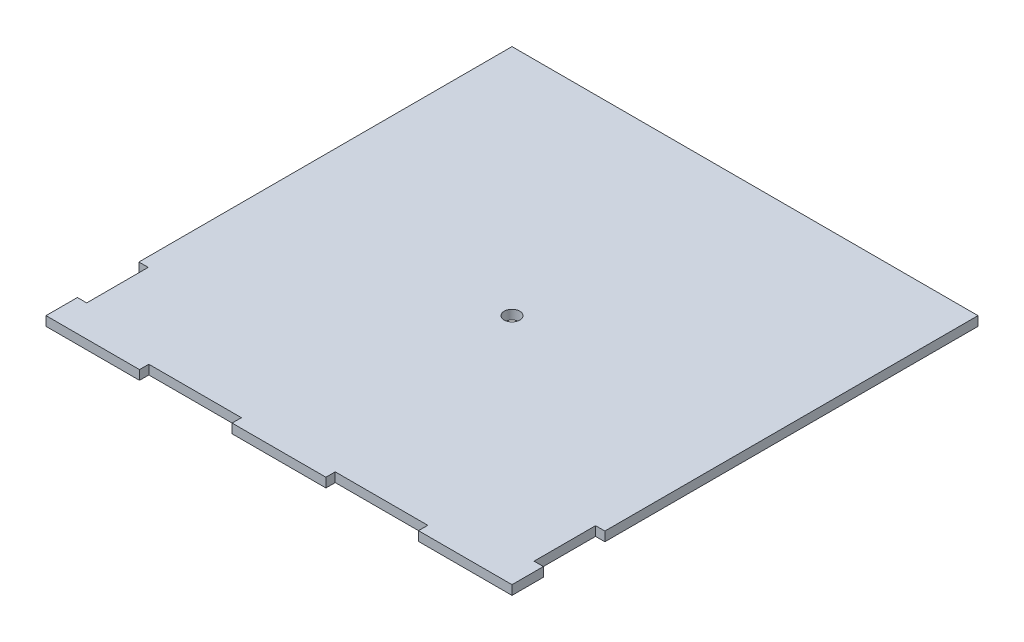
ISO-10303-21;
HEADER;
FILE_DESCRIPTION(('STEP AP214'),'2;1');
FILE_NAME('part.step','',(''),(''),'','','');
FILE_SCHEMA(('AUTOMOTIVE_DESIGN { 1 0 10303 214 1 1 1 1 }'));
ENDSEC;
DATA;
#1=APPLICATION_CONTEXT('core data for automotive mechanical design processes');
#2=APPLICATION_PROTOCOL_DEFINITION('international standard','automotive_design',2000,#1);
#3=PRODUCT_CONTEXT('',#1,'mechanical');
#4=PRODUCT('Part','Part','',(#3));
#5=PRODUCT_RELATED_PRODUCT_CATEGORY('part','',(#4));
#6=PRODUCT_DEFINITION_FORMATION('','',#4);
#7=PRODUCT_DEFINITION_CONTEXT('part definition',#1,'design');
#8=PRODUCT_DEFINITION('design','',#6,#7);
#9=PRODUCT_DEFINITION_SHAPE('','',#8);
#10=(LENGTH_UNIT() NAMED_UNIT(*) SI_UNIT(.MILLI.,.METRE.));
#11=(NAMED_UNIT(*) PLANE_ANGLE_UNIT() SI_UNIT($,.RADIAN.));
#12=(NAMED_UNIT(*) SI_UNIT($,.STERADIAN.) SOLID_ANGLE_UNIT());
#13=UNCERTAINTY_MEASURE_WITH_UNIT(LENGTH_MEASURE(1.E-05),#10,'distance_accuracy_value','');
#14=(GEOMETRIC_REPRESENTATION_CONTEXT(3) GLOBAL_UNCERTAINTY_ASSIGNED_CONTEXT((#13)) GLOBAL_UNIT_ASSIGNED_CONTEXT((#10,
#11,#12)) REPRESENTATION_CONTEXT('',''));
#15=CARTESIAN_POINT('',(0.,0.,0.));
#16=DIRECTION('',(0.,0.,1.));
#17=DIRECTION('',(1.,0.,0.));
#18=AXIS2_PLACEMENT_3D('',#15,#16,#17);
#19=CARTESIAN_POINT('',(0.,3.,0.));
#20=DIRECTION('',(-1.,0.,0.));
#21=DIRECTION('',(0.,0.,1.));
#22=AXIS2_PLACEMENT_3D('',#19,#20,#21);
#23=PLANE('',#22);
#24=DIRECTION('',(0.,0.,-1.));
#25=VECTOR('',#24,1.);
#26=CARTESIAN_POINT('',(0.,0.,0.));
#27=LINE('',#26,#25);
#28=CARTESIAN_POINT('',(0.,0.,-29.8999999999996));
#29=VERTEX_POINT('',#28);
#30=CARTESIAN_POINT('',(0.,0.,-150.));
#31=VERTEX_POINT('',#30);
#32=EDGE_CURVE('E208',#29,#31,#27,.T.);
#33=ORIENTED_EDGE('',*,*,#32,.F.);
#34=DIRECTION('',(0.,-1.,0.));
#35=VECTOR('',#34,1.);
#36=CARTESIAN_POINT('',(0.,3.,-29.8999999999996));
#37=LINE('',#36,#35);
#38=CARTESIAN_POINT('',(0.,3.,-29.8999999999996));
#39=VERTEX_POINT('',#38);
#40=EDGE_CURVE('E11',#39,#29,#37,.T.);
#41=ORIENTED_EDGE('',*,*,#40,.F.);
#42=DIRECTION('',(0.,0.,-1.));
#43=VECTOR('',#42,1.);
#44=CARTESIAN_POINT('',(0.,3.,0.));
#45=LINE('',#44,#43);
#46=CARTESIAN_POINT('',(0.,3.,-150.));
#47=VERTEX_POINT('',#46);
#48=EDGE_CURVE('E348',#39,#47,#45,.T.);
#49=ORIENTED_EDGE('',*,*,#48,.T.);
#50=DIRECTION('',(0.,-1.,0.));
#51=VECTOR('',#50,1.);
#52=CARTESIAN_POINT('',(0.,3.,-150.));
#53=LINE('',#52,#51);
#54=EDGE_CURVE('E53',#47,#31,#53,.T.);
#55=ORIENTED_EDGE('',*,*,#54,.T.);
#56=EDGE_LOOP('',(#33,#41,#49,#55));
#57=FACE_BOUND('',#56,.T.);
#58=ADVANCED_FACE('F36',(#57),#23,.T.);
#59=CARTESIAN_POINT('',(0.,3.,-29.8999999999996));
#60=DIRECTION('',(0.,0.,-1.));
#61=DIRECTION('',(-1.,0.,0.));
#62=AXIS2_PLACEMENT_3D('',#59,#60,#61);
#63=PLANE('',#62);
#64=DIRECTION('',(1.,0.,0.));
#65=VECTOR('',#64,1.);
#66=CARTESIAN_POINT('',(0.,0.,-29.8999999999996));
#67=LINE('',#66,#65);
#68=CARTESIAN_POINT('',(3.00000000000086,0.,-29.8999999999996));
#69=VERTEX_POINT('',#68);
#70=EDGE_CURVE('E210',#29,#69,#67,.T.);
#71=ORIENTED_EDGE('',*,*,#70,.T.);
#72=DIRECTION('',(0.,-1.,0.));
#73=VECTOR('',#72,1.);
#74=CARTESIAN_POINT('',(3.00000000000086,3.,-29.8999999999996));
#75=LINE('',#74,#73);
#76=CARTESIAN_POINT('',(3.00000000000086,3.,-29.8999999999996));
#77=VERTEX_POINT('',#76);
#78=EDGE_CURVE('E45',#77,#69,#75,.T.);
#79=ORIENTED_EDGE('',*,*,#78,.F.);
#80=DIRECTION('',(1.,0.,0.));
#81=VECTOR('',#80,1.);
#82=CARTESIAN_POINT('',(0.,3.,-29.8999999999996));
#83=LINE('',#82,#81);
#84=EDGE_CURVE('E352',#39,#77,#83,.T.);
#85=ORIENTED_EDGE('',*,*,#84,.F.);
#86=ORIENTED_EDGE('',*,*,#40,.T.);
#87=EDGE_LOOP('',(#71,#79,#85,#86));
#88=FACE_BOUND('',#87,.T.);
#89=ADVANCED_FACE('F303',(#88),#63,.F.);
#90=CARTESIAN_POINT('',(3.00000000000107,3.,0.));
#91=DIRECTION('',(1.,0.,0.));
#92=DIRECTION('',(0.,0.,-1.));
#93=AXIS2_PLACEMENT_3D('',#90,#91,#92);
#94=PLANE('',#93);
#95=DIRECTION('',(0.,0.,1.));
#96=VECTOR('',#95,1.);
#97=CARTESIAN_POINT('',(3.00000000000107,0.,0.));
#98=LINE('',#97,#96);
#99=CARTESIAN_POINT('',(3.000000000001,0.,-10.0999999999996));
#100=VERTEX_POINT('',#99);
#101=EDGE_CURVE('E214',#69,#100,#98,.T.);
#102=ORIENTED_EDGE('',*,*,#101,.T.);
#103=DIRECTION('',(0.,-1.,0.));
#104=VECTOR('',#103,1.);
#105=CARTESIAN_POINT('',(3.000000000001,3.,-10.0999999999996));
#106=LINE('',#105,#104);
#107=CARTESIAN_POINT('',(3.000000000001,3.,-10.0999999999996));
#108=VERTEX_POINT('',#107);
#109=EDGE_CURVE('E293',#108,#100,#106,.T.);
#110=ORIENTED_EDGE('',*,*,#109,.F.);
#111=DIRECTION('',(0.,0.,1.));
#112=VECTOR('',#111,1.);
#113=CARTESIAN_POINT('',(3.00000000000107,3.,0.));
#114=LINE('',#113,#112);
#115=EDGE_CURVE('E299',#77,#108,#114,.T.);
#116=ORIENTED_EDGE('',*,*,#115,.F.);
#117=ORIENTED_EDGE('',*,*,#78,.T.);
#118=EDGE_LOOP('',(#102,#110,#116,#117));
#119=FACE_BOUND('',#118,.T.);
#120=ADVANCED_FACE('F297',(#119),#94,.F.);
#121=CARTESIAN_POINT('',(0.,3.,-10.0999999999996));
#122=DIRECTION('',(0.,0.,-1.));
#123=DIRECTION('',(-1.,0.,0.));
#124=AXIS2_PLACEMENT_3D('',#121,#122,#123);
#125=PLANE('',#124);
#126=DIRECTION('',(1.,0.,0.));
#127=VECTOR('',#126,1.);
#128=CARTESIAN_POINT('',(0.,0.,-10.0999999999996));
#129=LINE('',#128,#127);
#130=CARTESIAN_POINT('',(0.,0.,-10.0999999999996));
#131=VERTEX_POINT('',#130);
#132=EDGE_CURVE('E217',#131,#100,#129,.T.);
#133=ORIENTED_EDGE('',*,*,#132,.F.);
#134=DIRECTION('',(0.,-1.,0.));
#135=VECTOR('',#134,1.);
#136=CARTESIAN_POINT('',(0.,3.,-10.0999999999996));
#137=LINE('',#136,#135);
#138=CARTESIAN_POINT('',(0.,3.,-10.0999999999996));
#139=VERTEX_POINT('',#138);
#140=EDGE_CURVE('E291',#139,#131,#137,.T.);
#141=ORIENTED_EDGE('',*,*,#140,.F.);
#142=DIRECTION('',(1.,0.,0.));
#143=VECTOR('',#142,1.);
#144=CARTESIAN_POINT('',(0.,3.,-10.0999999999996));
#145=LINE('',#144,#143);
#146=EDGE_CURVE('E346',#139,#108,#145,.T.);
#147=ORIENTED_EDGE('',*,*,#146,.T.);
#148=ORIENTED_EDGE('',*,*,#109,.T.);
#149=EDGE_LOOP('',(#133,#141,#147,#148));
#150=FACE_BOUND('',#149,.T.);
#151=ADVANCED_FACE('F316',(#150),#125,.T.);
#152=CARTESIAN_POINT('',(0.,0.,0.));
#153=VERTEX_POINT('',#152);
#154=EDGE_CURVE('E211',#153,#131,#27,.T.);
#155=ORIENTED_EDGE('',*,*,#154,.F.);
#156=DIRECTION('',(0.,-1.,0.));
#157=VECTOR('',#156,1.);
#158=CARTESIAN_POINT('',(0.,3.,0.));
#159=LINE('',#158,#157);
#160=CARTESIAN_POINT('',(0.,3.,0.));
#161=VERTEX_POINT('',#160);
#162=EDGE_CURVE('E289',#161,#153,#159,.T.);
#163=ORIENTED_EDGE('',*,*,#162,.F.);
#164=EDGE_CURVE('E340',#161,#139,#45,.T.);
#165=ORIENTED_EDGE('',*,*,#164,.T.);
#166=ORIENTED_EDGE('',*,*,#140,.T.);
#167=EDGE_LOOP('',(#155,#163,#165,#166));
#168=FACE_BOUND('',#167,.T.);
#169=ADVANCED_FACE('F308',(#168),#23,.T.);
#170=CARTESIAN_POINT('',(0.,3.,0.));
#171=DIRECTION('',(0.,0.,-1.));
#172=DIRECTION('',(-1.,0.,0.));
#173=AXIS2_PLACEMENT_3D('',#170,#171,#172);
#174=PLANE('',#173);
#175=DIRECTION('',(1.,0.,0.));
#176=VECTOR('',#175,1.);
#177=CARTESIAN_POINT('',(0.,0.,0.));
#178=LINE('',#177,#176);
#179=CARTESIAN_POINT('',(30.1,0.,0.));
#180=VERTEX_POINT('',#179);
#181=EDGE_CURVE('E220',#153,#180,#178,.T.);
#182=ORIENTED_EDGE('',*,*,#181,.T.);
#183=DIRECTION('',(0.,-1.,0.));
#184=VECTOR('',#183,1.);
#185=CARTESIAN_POINT('',(30.1,3.,0.));
#186=LINE('',#185,#184);
#187=CARTESIAN_POINT('',(30.1,3.,0.));
#188=VERTEX_POINT('',#187);
#189=EDGE_CURVE('E286',#188,#180,#186,.T.);
#190=ORIENTED_EDGE('',*,*,#189,.F.);
#191=DIRECTION('',(1.,0.,0.));
#192=VECTOR('',#191,1.);
#193=CARTESIAN_POINT('',(0.,3.,0.));
#194=LINE('',#193,#192);
#195=EDGE_CURVE('E336',#161,#188,#194,.T.);
#196=ORIENTED_EDGE('',*,*,#195,.F.);
#197=ORIENTED_EDGE('',*,*,#162,.T.);
#198=EDGE_LOOP('',(#182,#190,#196,#197));
#199=FACE_BOUND('',#198,.T.);
#200=ADVANCED_FACE('F315',(#199),#174,.F.);
#201=CARTESIAN_POINT('',(30.1,3.,0.));
#202=DIRECTION('',(-1.,0.,0.));
#203=DIRECTION('',(0.,0.,1.));
#204=AXIS2_PLACEMENT_3D('',#201,#202,#203);
#205=PLANE('',#204);
#206=DIRECTION('',(0.,0.,-1.));
#207=VECTOR('',#206,1.);
#208=CARTESIAN_POINT('',(30.1,0.,0.));
#209=LINE('',#208,#207);
#210=CARTESIAN_POINT('',(30.1,0.,-3.));
#211=VERTEX_POINT('',#210);
#212=EDGE_CURVE('E223',#180,#211,#209,.T.);
#213=ORIENTED_EDGE('',*,*,#212,.T.);
#214=DIRECTION('',(0.,-1.,0.));
#215=VECTOR('',#214,1.);
#216=CARTESIAN_POINT('',(30.1,3.,-3.));
#217=LINE('',#216,#215);
#218=CARTESIAN_POINT('',(30.1,3.,-3.));
#219=VERTEX_POINT('',#218);
#220=EDGE_CURVE('E283',#219,#211,#217,.T.);
#221=ORIENTED_EDGE('',*,*,#220,.F.);
#222=DIRECTION('',(0.,0.,-1.));
#223=VECTOR('',#222,1.);
#224=CARTESIAN_POINT('',(30.1,3.,0.));
#225=LINE('',#224,#223);
#226=EDGE_CURVE('E339',#188,#219,#225,.T.);
#227=ORIENTED_EDGE('',*,*,#226,.F.);
#228=ORIENTED_EDGE('',*,*,#189,.T.);
#229=EDGE_LOOP('',(#213,#221,#227,#228));
#230=FACE_BOUND('',#229,.T.);
#231=ADVANCED_FACE('F322',(#230),#205,.F.);
#232=CARTESIAN_POINT('',(0.,3.,-3.));
#233=DIRECTION('',(0.,0.,-1.));
#234=DIRECTION('',(-1.,0.,0.));
#235=AXIS2_PLACEMENT_3D('',#232,#233,#234);
#236=PLANE('',#235);
#237=DIRECTION('',(1.,0.,0.));
#238=VECTOR('',#237,1.);
#239=CARTESIAN_POINT('',(0.,0.,-3.));
#240=LINE('',#239,#238);
#241=CARTESIAN_POINT('',(59.9,0.,-3.));
#242=VERTEX_POINT('',#241);
#243=EDGE_CURVE('E228',#211,#242,#240,.T.);
#244=ORIENTED_EDGE('',*,*,#243,.T.);
#245=DIRECTION('',(0.,-1.,0.));
#246=VECTOR('',#245,1.);
#247=CARTESIAN_POINT('',(59.9,3.,-3.));
#248=LINE('',#247,#246);
#249=CARTESIAN_POINT('',(59.9,3.,-3.));
#250=VERTEX_POINT('',#249);
#251=EDGE_CURVE('E281',#250,#242,#248,.T.);
#252=ORIENTED_EDGE('',*,*,#251,.F.);
#253=DIRECTION('',(1.,0.,0.));
#254=VECTOR('',#253,1.);
#255=CARTESIAN_POINT('',(0.,3.,-3.));
#256=LINE('',#255,#254);
#257=EDGE_CURVE('E408',#219,#250,#256,.T.);
#258=ORIENTED_EDGE('',*,*,#257,.F.);
#259=ORIENTED_EDGE('',*,*,#220,.T.);
#260=EDGE_LOOP('',(#244,#252,#258,#259));
#261=FACE_BOUND('',#260,.T.);
#262=ADVANCED_FACE('F399',(#261),#236,.F.);
#263=CARTESIAN_POINT('',(59.9,3.,0.));
#264=DIRECTION('',(-1.,0.,0.));
#265=DIRECTION('',(0.,0.,1.));
#266=AXIS2_PLACEMENT_3D('',#263,#264,#265);
#267=PLANE('',#266);
#268=DIRECTION('',(0.,0.,-1.));
#269=VECTOR('',#268,1.);
#270=CARTESIAN_POINT('',(59.9,0.,0.));
#271=LINE('',#270,#269);
#272=CARTESIAN_POINT('',(59.9,0.,0.));
#273=VERTEX_POINT('',#272);
#274=EDGE_CURVE('E231',#273,#242,#271,.T.);
#275=ORIENTED_EDGE('',*,*,#274,.F.);
#276=DIRECTION('',(0.,-1.,0.));
#277=VECTOR('',#276,1.);
#278=CARTESIAN_POINT('',(59.9,3.,0.));
#279=LINE('',#278,#277);
#280=CARTESIAN_POINT('',(59.9,3.,0.));
#281=VERTEX_POINT('',#280);
#282=EDGE_CURVE('E279',#281,#273,#279,.T.);
#283=ORIENTED_EDGE('',*,*,#282,.F.);
#284=DIRECTION('',(0.,0.,-1.));
#285=VECTOR('',#284,1.);
#286=CARTESIAN_POINT('',(59.9,3.,0.));
#287=LINE('',#286,#285);
#288=EDGE_CURVE('E410',#281,#250,#287,.T.);
#289=ORIENTED_EDGE('',*,*,#288,.T.);
#290=ORIENTED_EDGE('',*,*,#251,.T.);
#291=EDGE_LOOP('',(#275,#283,#289,#290));
#292=FACE_BOUND('',#291,.T.);
#293=ADVANCED_FACE('F396',(#292),#267,.T.);
#294=CARTESIAN_POINT('',(90.1,0.,0.));
#295=VERTEX_POINT('',#294);
#296=EDGE_CURVE('E225',#273,#295,#178,.T.);
#297=ORIENTED_EDGE('',*,*,#296,.T.);
#298=DIRECTION('',(0.,-1.,0.));
#299=VECTOR('',#298,1.);
#300=CARTESIAN_POINT('',(90.1,3.,0.));
#301=LINE('',#300,#299);
#302=CARTESIAN_POINT('',(90.1,3.,0.));
#303=VERTEX_POINT('',#302);
#304=EDGE_CURVE('E276',#303,#295,#301,.T.);
#305=ORIENTED_EDGE('',*,*,#304,.F.);
#306=EDGE_CURVE('E343',#281,#303,#194,.T.);
#307=ORIENTED_EDGE('',*,*,#306,.F.);
#308=ORIENTED_EDGE('',*,*,#282,.T.);
#309=EDGE_LOOP('',(#297,#305,#307,#308));
#310=FACE_BOUND('',#309,.T.);
#311=ADVANCED_FACE('F325',(#310),#174,.F.);
#312=CARTESIAN_POINT('',(90.1,3.,0.));
#313=DIRECTION('',(-1.,0.,0.));
#314=DIRECTION('',(0.,0.,1.));
#315=AXIS2_PLACEMENT_3D('',#312,#313,#314);
#316=PLANE('',#315);
#317=DIRECTION('',(0.,0.,-1.));
#318=VECTOR('',#317,1.);
#319=CARTESIAN_POINT('',(90.1,0.,0.));
#320=LINE('',#319,#318);
#321=CARTESIAN_POINT('',(90.1,0.,-3.));
#322=VERTEX_POINT('',#321);
#323=EDGE_CURVE('E234',#295,#322,#320,.T.);
#324=ORIENTED_EDGE('',*,*,#323,.T.);
#325=DIRECTION('',(0.,-1.,0.));
#326=VECTOR('',#325,1.);
#327=CARTESIAN_POINT('',(90.1,3.,-3.));
#328=LINE('',#327,#326);
#329=CARTESIAN_POINT('',(90.1,3.,-3.));
#330=VERTEX_POINT('',#329);
#331=EDGE_CURVE('E273',#330,#322,#328,.T.);
#332=ORIENTED_EDGE('',*,*,#331,.F.);
#333=DIRECTION('',(0.,0.,-1.));
#334=VECTOR('',#333,1.);
#335=CARTESIAN_POINT('',(90.1,3.,0.));
#336=LINE('',#335,#334);
#337=EDGE_CURVE('E415',#303,#330,#336,.T.);
#338=ORIENTED_EDGE('',*,*,#337,.F.);
#339=ORIENTED_EDGE('',*,*,#304,.T.);
#340=EDGE_LOOP('',(#324,#332,#338,#339));
#341=FACE_BOUND('',#340,.T.);
#342=ADVANCED_FACE('F391',(#341),#316,.F.);
#343=CARTESIAN_POINT('',(0.,3.,-3.));
#344=DIRECTION('',(0.,0.,-1.));
#345=DIRECTION('',(-1.,0.,0.));
#346=AXIS2_PLACEMENT_3D('',#343,#344,#345);
#347=PLANE('',#346);
#348=DIRECTION('',(1.,0.,0.));
#349=VECTOR('',#348,1.);
#350=CARTESIAN_POINT('',(0.,0.,-3.));
#351=LINE('',#350,#349);
#352=CARTESIAN_POINT('',(119.9,0.,-3.));
#353=VERTEX_POINT('',#352);
#354=EDGE_CURVE('E237',#322,#353,#351,.T.);
#355=ORIENTED_EDGE('',*,*,#354,.T.);
#356=DIRECTION('',(0.,-1.,0.));
#357=VECTOR('',#356,1.);
#358=CARTESIAN_POINT('',(119.9,3.,-3.));
#359=LINE('',#358,#357);
#360=CARTESIAN_POINT('',(119.9,3.,-3.));
#361=VERTEX_POINT('',#360);
#362=EDGE_CURVE('E271',#361,#353,#359,.T.);
#363=ORIENTED_EDGE('',*,*,#362,.F.);
#364=DIRECTION('',(1.,0.,0.));
#365=VECTOR('',#364,1.);
#366=CARTESIAN_POINT('',(0.,3.,-3.));
#367=LINE('',#366,#365);
#368=EDGE_CURVE('E418',#330,#361,#367,.T.);
#369=ORIENTED_EDGE('',*,*,#368,.F.);
#370=ORIENTED_EDGE('',*,*,#331,.T.);
#371=EDGE_LOOP('',(#355,#363,#369,#370));
#372=FACE_BOUND('',#371,.T.);
#373=ADVANCED_FACE('F387',(#372),#347,.F.);
#374=CARTESIAN_POINT('',(119.9,3.,0.));
#375=DIRECTION('',(-1.,0.,0.));
#376=DIRECTION('',(0.,0.,1.));
#377=AXIS2_PLACEMENT_3D('',#374,#375,#376);
#378=PLANE('',#377);
#379=DIRECTION('',(0.,0.,-1.));
#380=VECTOR('',#379,1.);
#381=CARTESIAN_POINT('',(119.9,0.,0.));
#382=LINE('',#381,#380);
#383=CARTESIAN_POINT('',(119.9,0.,0.));
#384=VERTEX_POINT('',#383);
#385=EDGE_CURVE('E240',#384,#353,#382,.T.);
#386=ORIENTED_EDGE('',*,*,#385,.F.);
#387=DIRECTION('',(0.,-1.,0.));
#388=VECTOR('',#387,1.);
#389=CARTESIAN_POINT('',(119.9,3.,0.));
#390=LINE('',#389,#388);
#391=CARTESIAN_POINT('',(119.9,3.,0.));
#392=VERTEX_POINT('',#391);
#393=EDGE_CURVE('E269',#392,#384,#390,.T.);
#394=ORIENTED_EDGE('',*,*,#393,.F.);
#395=DIRECTION('',(0.,0.,-1.));
#396=VECTOR('',#395,1.);
#397=CARTESIAN_POINT('',(119.9,3.,0.));
#398=LINE('',#397,#396);
#399=EDGE_CURVE('E420',#392,#361,#398,.T.);
#400=ORIENTED_EDGE('',*,*,#399,.T.);
#401=ORIENTED_EDGE('',*,*,#362,.T.);
#402=EDGE_LOOP('',(#386,#394,#400,#401));
#403=FACE_BOUND('',#402,.T.);
#404=ADVANCED_FACE('F383',(#403),#378,.T.);
#405=CARTESIAN_POINT('',(150.,0.,0.));
#406=VERTEX_POINT('',#405);
#407=EDGE_CURVE('E224',#384,#406,#178,.T.);
#408=ORIENTED_EDGE('',*,*,#407,.T.);
#409=DIRECTION('',(0.,-1.,0.));
#410=VECTOR('',#409,1.);
#411=CARTESIAN_POINT('',(150.,3.,0.));
#412=LINE('',#411,#410);
#413=CARTESIAN_POINT('',(150.,3.,0.));
#414=VERTEX_POINT('',#413);
#415=EDGE_CURVE('E266',#414,#406,#412,.T.);
#416=ORIENTED_EDGE('',*,*,#415,.F.);
#417=EDGE_CURVE('E342',#392,#414,#194,.T.);
#418=ORIENTED_EDGE('',*,*,#417,.F.);
#419=ORIENTED_EDGE('',*,*,#393,.T.);
#420=EDGE_LOOP('',(#408,#416,#418,#419));
#421=FACE_BOUND('',#420,.T.);
#422=ADVANCED_FACE('F326',(#421),#174,.F.);
#423=CARTESIAN_POINT('',(150.,3.,0.));
#424=DIRECTION('',(-1.,0.,0.));
#425=DIRECTION('',(0.,0.,1.));
#426=AXIS2_PLACEMENT_3D('',#423,#424,#425);
#427=PLANE('',#426);
#428=DIRECTION('',(0.,0.,-1.));
#429=VECTOR('',#428,1.);
#430=CARTESIAN_POINT('',(150.,0.,0.));
#431=LINE('',#430,#429);
#432=CARTESIAN_POINT('',(150.,0.,-10.1));
#433=VERTEX_POINT('',#432);
#434=EDGE_CURVE('E243',#406,#433,#431,.T.);
#435=ORIENTED_EDGE('',*,*,#434,.T.);
#436=DIRECTION('',(0.,-1.,0.));
#437=VECTOR('',#436,1.);
#438=CARTESIAN_POINT('',(150.,3.,-10.1));
#439=LINE('',#438,#437);
#440=CARTESIAN_POINT('',(150.,3.,-10.1));
#441=VERTEX_POINT('',#440);
#442=EDGE_CURVE('E263',#441,#433,#439,.T.);
#443=ORIENTED_EDGE('',*,*,#442,.F.);
#444=DIRECTION('',(0.,0.,-1.));
#445=VECTOR('',#444,1.);
#446=CARTESIAN_POINT('',(150.,3.,0.));
#447=LINE('',#446,#445);
#448=EDGE_CURVE('E193',#414,#441,#447,.T.);
#449=ORIENTED_EDGE('',*,*,#448,.F.);
#450=ORIENTED_EDGE('',*,*,#415,.T.);
#451=EDGE_LOOP('',(#435,#443,#449,#450));
#452=FACE_BOUND('',#451,.T.);
#453=ADVANCED_FACE('F371',(#452),#427,.F.);
#454=CARTESIAN_POINT('',(0.,3.,-10.0999999999999));
#455=DIRECTION('',(0.,0.,1.));
#456=DIRECTION('',(1.,0.,0.));
#457=AXIS2_PLACEMENT_3D('',#454,#455,#456);
#458=PLANE('',#457);
#459=DIRECTION('',(-1.,0.,0.));
#460=VECTOR('',#459,1.);
#461=CARTESIAN_POINT('',(0.,0.,-10.0999999999999));
#462=LINE('',#461,#460);
#463=CARTESIAN_POINT('',(147.,0.,-10.1));
#464=VERTEX_POINT('',#463);
#465=EDGE_CURVE('E246',#433,#464,#462,.T.);
#466=ORIENTED_EDGE('',*,*,#465,.T.);
#467=DIRECTION('',(0.,-1.,0.));
#468=VECTOR('',#467,1.);
#469=CARTESIAN_POINT('',(147.,3.,-10.1));
#470=LINE('',#469,#468);
#471=CARTESIAN_POINT('',(147.,3.,-10.1));
#472=VERTEX_POINT('',#471);
#473=EDGE_CURVE('E261',#472,#464,#470,.T.);
#474=ORIENTED_EDGE('',*,*,#473,.F.);
#475=DIRECTION('',(-1.,0.,0.));
#476=VECTOR('',#475,1.);
#477=CARTESIAN_POINT('',(0.,3.,-10.0999999999999));
#478=LINE('',#477,#476);
#479=EDGE_CURVE('E200',#441,#472,#478,.T.);
#480=ORIENTED_EDGE('',*,*,#479,.F.);
#481=ORIENTED_EDGE('',*,*,#442,.T.);
#482=EDGE_LOOP('',(#466,#474,#480,#481));
#483=FACE_BOUND('',#482,.T.);
#484=ADVANCED_FACE('F377',(#483),#458,.F.);
#485=CARTESIAN_POINT('',(147.,3.,0.));
#486=DIRECTION('',(1.,0.,0.));
#487=DIRECTION('',(0.,0.,-1.));
#488=AXIS2_PLACEMENT_3D('',#485,#486,#487);
#489=PLANE('',#488);
#490=DIRECTION('',(0.,0.,1.));
#491=VECTOR('',#490,1.);
#492=CARTESIAN_POINT('',(147.,0.,0.));
#493=LINE('',#492,#491);
#494=CARTESIAN_POINT('',(147.,0.,-29.9));
#495=VERTEX_POINT('',#494);
#496=EDGE_CURVE('E250',#495,#464,#493,.T.);
#497=ORIENTED_EDGE('',*,*,#496,.F.);
#498=DIRECTION('',(0.,-1.,0.));
#499=VECTOR('',#498,1.);
#500=CARTESIAN_POINT('',(147.,3.,-29.9));
#501=LINE('',#500,#499);
#502=CARTESIAN_POINT('',(147.,3.,-29.9));
#503=VERTEX_POINT('',#502);
#504=EDGE_CURVE('E185',#503,#495,#501,.T.);
#505=ORIENTED_EDGE('',*,*,#504,.F.);
#506=DIRECTION('',(0.,0.,1.));
#507=VECTOR('',#506,1.);
#508=CARTESIAN_POINT('',(147.,3.,0.));
#509=LINE('',#508,#507);
#510=EDGE_CURVE('E198',#503,#472,#509,.T.);
#511=ORIENTED_EDGE('',*,*,#510,.T.);
#512=ORIENTED_EDGE('',*,*,#473,.T.);
#513=EDGE_LOOP('',(#497,#505,#511,#512));
#514=FACE_BOUND('',#513,.T.);
#515=ADVANCED_FACE('F374',(#514),#489,.T.);
#516=CARTESIAN_POINT('',(0.,3.,-29.9));
#517=DIRECTION('',(0.,0.,1.));
#518=DIRECTION('',(1.,0.,0.));
#519=AXIS2_PLACEMENT_3D('',#516,#517,#518);
#520=PLANE('',#519);
#521=DIRECTION('',(-1.,0.,0.));
#522=VECTOR('',#521,1.);
#523=CARTESIAN_POINT('',(0.,0.,-29.9));
#524=LINE('',#523,#522);
#525=CARTESIAN_POINT('',(150.,0.,-29.9));
#526=VERTEX_POINT('',#525);
#527=EDGE_CURVE('E182',#526,#495,#524,.T.);
#528=ORIENTED_EDGE('',*,*,#527,.F.);
#529=DIRECTION('',(0.,-1.,0.));
#530=VECTOR('',#529,1.);
#531=CARTESIAN_POINT('',(150.,3.,-29.9));
#532=LINE('',#531,#530);
#533=CARTESIAN_POINT('',(150.,3.,-29.9));
#534=VERTEX_POINT('',#533);
#535=EDGE_CURVE('E176',#534,#526,#532,.T.);
#536=ORIENTED_EDGE('',*,*,#535,.F.);
#537=DIRECTION('',(-1.,0.,0.));
#538=VECTOR('',#537,1.);
#539=CARTESIAN_POINT('',(0.,3.,-29.9));
#540=LINE('',#539,#538);
#541=EDGE_CURVE('E180',#534,#503,#540,.T.);
#542=ORIENTED_EDGE('',*,*,#541,.T.);
#543=ORIENTED_EDGE('',*,*,#504,.T.);
#544=EDGE_LOOP('',(#528,#536,#542,#543));
#545=FACE_BOUND('',#544,.T.);
#546=ADVANCED_FACE('F178',(#545),#520,.T.);
#547=CARTESIAN_POINT('',(150.,0.,-150.));
#548=VERTEX_POINT('',#547);
#549=EDGE_CURVE('E247',#526,#548,#431,.T.);
#550=ORIENTED_EDGE('',*,*,#549,.T.);
#551=DIRECTION('',(0.,-1.,0.));
#552=VECTOR('',#551,1.);
#553=CARTESIAN_POINT('',(150.,3.,-150.));
#554=LINE('',#553,#552);
#555=CARTESIAN_POINT('',(150.,3.,-150.));
#556=VERTEX_POINT('',#555);
#557=EDGE_CURVE('E115',#556,#548,#554,.T.);
#558=ORIENTED_EDGE('',*,*,#557,.F.);
#559=EDGE_CURVE('E187',#534,#556,#447,.T.);
#560=ORIENTED_EDGE('',*,*,#559,.F.);
#561=ORIENTED_EDGE('',*,*,#535,.T.);
#562=EDGE_LOOP('',(#550,#558,#560,#561));
#563=FACE_BOUND('',#562,.T.);
#564=ADVANCED_FACE('F188',(#563),#427,.F.);
#565=CARTESIAN_POINT('',(74.9999999999944,3.,-74.9999999999943));
#566=DIRECTION('',(0.,-1.,0.));
#567=DIRECTION('',(0.,0.,-1.));
#568=AXIS2_PLACEMENT_3D('',#565,#566,#567);
#569=CYLINDRICAL_SURFACE('',#568,2.50000000000001);
#570=CARTESIAN_POINT('',(74.9999999999944,3.,-74.9999999999943));
#571=DIRECTION('',(0.,1.,0.));
#572=DIRECTION('',(0.,0.,1.));
#573=AXIS2_PLACEMENT_3D('',#570,#571,#572);
#574=CIRCLE('',#573,2.50000000000001);
#575=CARTESIAN_POINT('',(74.9999999999944,3.,-72.4999999999943));
#576=VERTEX_POINT('',#575);
#577=EDGE_CURVE('E257',#576,#576,#574,.T.);
#578=ORIENTED_EDGE('',*,*,#577,.T.);
#579=EDGE_LOOP('',(#578));
#580=FACE_BOUND('',#579,.T.);
#581=CARTESIAN_POINT('',(74.9999999999944,0.,-74.9999999999943));
#582=DIRECTION('',(0.,1.,0.));
#583=DIRECTION('',(0.,0.,1.));
#584=AXIS2_PLACEMENT_3D('',#581,#582,#583);
#585=CIRCLE('',#584,2.50000000000001);
#586=CARTESIAN_POINT('',(74.9999999999944,0.,-72.4999999999943));
#587=VERTEX_POINT('',#586);
#588=EDGE_CURVE('E205',#587,#587,#585,.T.);
#589=ORIENTED_EDGE('',*,*,#588,.F.);
#590=EDGE_LOOP('',(#589));
#591=FACE_BOUND('',#590,.T.);
#592=ADVANCED_FACE('F38',(#580,#591),#569,.F.);
#593=CARTESIAN_POINT('',(0.,3.,-150.));
#594=DIRECTION('',(0.,0.,-1.));
#595=DIRECTION('',(-1.,0.,0.));
#596=AXIS2_PLACEMENT_3D('',#593,#594,#595);
#597=PLANE('',#596);
#598=DIRECTION('',(1.,0.,0.));
#599=VECTOR('',#598,1.);
#600=CARTESIAN_POINT('',(0.,0.,-150.));
#601=LINE('',#600,#599);
#602=EDGE_CURVE('E254',#31,#548,#601,.T.);
#603=ORIENTED_EDGE('',*,*,#602,.F.);
#604=ORIENTED_EDGE('',*,*,#54,.F.);
#605=DIRECTION('',(1.,0.,0.));
#606=VECTOR('',#605,1.);
#607=CARTESIAN_POINT('',(0.,3.,-150.));
#608=LINE('',#607,#606);
#609=EDGE_CURVE('E191',#47,#556,#608,.T.);
#610=ORIENTED_EDGE('',*,*,#609,.T.);
#611=ORIENTED_EDGE('',*,*,#557,.T.);
#612=EDGE_LOOP('',(#603,#604,#610,#611));
#613=FACE_BOUND('',#612,.T.);
#614=ADVANCED_FACE('F359',(#613),#597,.T.);
#615=CARTESIAN_POINT('',(0.,3.,0.));
#616=DIRECTION('',(0.,1.,0.));
#617=DIRECTION('',(0.,0.,1.));
#618=AXIS2_PLACEMENT_3D('',#615,#616,#617);
#619=PLANE('',#618);
#620=ORIENTED_EDGE('',*,*,#577,.F.);
#621=EDGE_LOOP('',(#620));
#622=FACE_BOUND('',#621,.T.);
#623=ORIENTED_EDGE('',*,*,#48,.F.);
#624=ORIENTED_EDGE('',*,*,#84,.T.);
#625=ORIENTED_EDGE('',*,*,#115,.T.);
#626=ORIENTED_EDGE('',*,*,#146,.F.);
#627=ORIENTED_EDGE('',*,*,#164,.F.);
#628=ORIENTED_EDGE('',*,*,#195,.T.);
#629=ORIENTED_EDGE('',*,*,#226,.T.);
#630=ORIENTED_EDGE('',*,*,#257,.T.);
#631=ORIENTED_EDGE('',*,*,#288,.F.);
#632=ORIENTED_EDGE('',*,*,#306,.T.);
#633=ORIENTED_EDGE('',*,*,#337,.T.);
#634=ORIENTED_EDGE('',*,*,#368,.T.);
#635=ORIENTED_EDGE('',*,*,#399,.F.);
#636=ORIENTED_EDGE('',*,*,#417,.T.);
#637=ORIENTED_EDGE('',*,*,#448,.T.);
#638=ORIENTED_EDGE('',*,*,#479,.T.);
#639=ORIENTED_EDGE('',*,*,#510,.F.);
#640=ORIENTED_EDGE('',*,*,#541,.F.);
#641=ORIENTED_EDGE('',*,*,#559,.T.);
#642=ORIENTED_EDGE('',*,*,#609,.F.);
#643=EDGE_LOOP('',(#623,#624,#625,#626,#627,#628,#629,#630,#631,#632,#633,#634,#635,#636,#637,
#638,#639,#640,#641,#642));
#644=FACE_BOUND('',#643,.T.);
#645=ADVANCED_FACE('F196',(#622,#644),#619,.T.);
#646=CARTESIAN_POINT('',(0.,0.,0.));
#647=DIRECTION('',(0.,1.,0.));
#648=DIRECTION('',(0.,0.,1.));
#649=AXIS2_PLACEMENT_3D('',#646,#647,#648);
#650=PLANE('',#649);
#651=ORIENTED_EDGE('',*,*,#588,.T.);
#652=EDGE_LOOP('',(#651));
#653=FACE_BOUND('',#652,.T.);
#654=ORIENTED_EDGE('',*,*,#32,.T.);
#655=ORIENTED_EDGE('',*,*,#602,.T.);
#656=ORIENTED_EDGE('',*,*,#549,.F.);
#657=ORIENTED_EDGE('',*,*,#527,.T.);
#658=ORIENTED_EDGE('',*,*,#496,.T.);
#659=ORIENTED_EDGE('',*,*,#465,.F.);
#660=ORIENTED_EDGE('',*,*,#434,.F.);
#661=ORIENTED_EDGE('',*,*,#407,.F.);
#662=ORIENTED_EDGE('',*,*,#385,.T.);
#663=ORIENTED_EDGE('',*,*,#354,.F.);
#664=ORIENTED_EDGE('',*,*,#323,.F.);
#665=ORIENTED_EDGE('',*,*,#296,.F.);
#666=ORIENTED_EDGE('',*,*,#274,.T.);
#667=ORIENTED_EDGE('',*,*,#243,.F.);
#668=ORIENTED_EDGE('',*,*,#212,.F.);
#669=ORIENTED_EDGE('',*,*,#181,.F.);
#670=ORIENTED_EDGE('',*,*,#154,.T.);
#671=ORIENTED_EDGE('',*,*,#132,.T.);
#672=ORIENTED_EDGE('',*,*,#101,.F.);
#673=ORIENTED_EDGE('',*,*,#70,.F.);
#674=EDGE_LOOP('',(#654,#655,#656,#657,#658,#659,#660,#661,#662,#663,#664,#665,#666,#667,#668,
#669,#670,#671,#672,#673));
#675=FACE_BOUND('',#674,.T.);
#676=ADVANCED_FACE('F305',(#653,#675),#650,.F.);
#677=CLOSED_SHELL('',(#58,#89,#120,#151,#169,#200,#231,#262,#293,#311,#342,#373,#404,#422,#453,
#484,#515,#546,#564,#592,#614,#645,#676));
#678=MANIFOLD_SOLID_BREP('B2',#677);
#679=ADVANCED_BREP_SHAPE_REPRESENTATION('',(#18,#678),#14);
#680=SHAPE_DEFINITION_REPRESENTATION(#9,#679);
ENDSEC;
END-ISO-10303-21;
